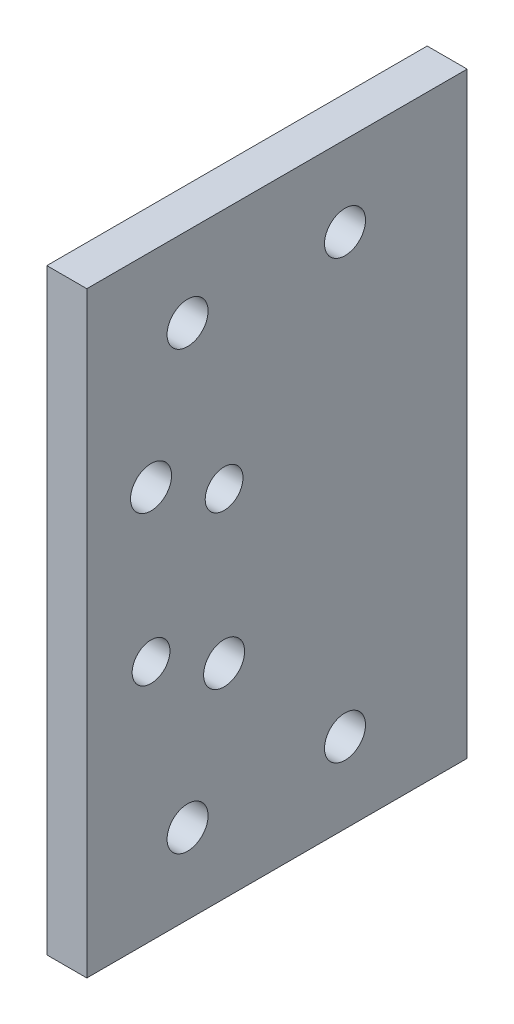
ISO-10303-21;
HEADER;
FILE_DESCRIPTION(('STEP AP214'),'2;1');
FILE_NAME('part.step','',(''),(''),'','','');
FILE_SCHEMA(('AUTOMOTIVE_DESIGN { 1 0 10303 214 1 1 1 1 }'));
ENDSEC;
DATA;
#1=APPLICATION_CONTEXT('core data for automotive mechanical design processes');
#2=APPLICATION_PROTOCOL_DEFINITION('international standard','automotive_design',2000,#1);
#3=PRODUCT_CONTEXT('',#1,'mechanical');
#4=PRODUCT('Part','Part','',(#3));
#5=PRODUCT_RELATED_PRODUCT_CATEGORY('part','',(#4));
#6=PRODUCT_DEFINITION_FORMATION('','',#4);
#7=PRODUCT_DEFINITION_CONTEXT('part definition',#1,'design');
#8=PRODUCT_DEFINITION('design','',#6,#7);
#9=PRODUCT_DEFINITION_SHAPE('','',#8);
#10=(LENGTH_UNIT() NAMED_UNIT(*) SI_UNIT(.MILLI.,.METRE.));
#11=(NAMED_UNIT(*) PLANE_ANGLE_UNIT() SI_UNIT($,.RADIAN.));
#12=(NAMED_UNIT(*) SI_UNIT($,.STERADIAN.) SOLID_ANGLE_UNIT());
#13=UNCERTAINTY_MEASURE_WITH_UNIT(LENGTH_MEASURE(1.E-05),#10,'distance_accuracy_value','');
#14=(GEOMETRIC_REPRESENTATION_CONTEXT(3) GLOBAL_UNCERTAINTY_ASSIGNED_CONTEXT((#13)) GLOBAL_UNIT_ASSIGNED_CONTEXT((#10,
#11,#12)) REPRESENTATION_CONTEXT('',''));
#15=CARTESIAN_POINT('',(0.,0.,0.));
#16=DIRECTION('',(0.,0.,1.));
#17=DIRECTION('',(1.,0.,0.));
#18=AXIS2_PLACEMENT_3D('',#15,#16,#17);
#19=CARTESIAN_POINT('',(6.35,0.,0.));
#20=DIRECTION('',(-1.,0.,0.));
#21=DIRECTION('',(0.,0.,1.));
#22=AXIS2_PLACEMENT_3D('',#19,#20,#21);
#23=PLANE('',#22);
#24=DIRECTION('',(0.,0.,-1.));
#25=VECTOR('',#24,1.);
#26=CARTESIAN_POINT('',(6.35,-47.4,-25.));
#27=LINE('',#26,#25);
#28=CARTESIAN_POINT('',(6.35,-47.4,16.));
#29=VERTEX_POINT('',#28);
#30=CARTESIAN_POINT('',(6.35,-47.4,-44.4));
#31=VERTEX_POINT('',#30);
#32=EDGE_CURVE('E102',#29,#31,#27,.T.);
#33=ORIENTED_EDGE('',*,*,#32,.T.);
#34=DIRECTION('',(0.,-1.,0.));
#35=VECTOR('',#34,1.);
#36=CARTESIAN_POINT('',(6.35,-47.4,-44.4));
#37=LINE('',#36,#35);
#38=CARTESIAN_POINT('',(6.35,47.4,-44.4));
#39=VERTEX_POINT('',#38);
#40=EDGE_CURVE('E182',#39,#31,#37,.T.);
#41=ORIENTED_EDGE('',*,*,#40,.F.);
#42=DIRECTION('',(0.,0.,1.));
#43=VECTOR('',#42,1.);
#44=CARTESIAN_POINT('',(6.35,47.4,-69.8));
#45=LINE('',#44,#43);
#46=CARTESIAN_POINT('',(6.35,47.4,16.));
#47=VERTEX_POINT('',#46);
#48=EDGE_CURVE('E106',#39,#47,#45,.T.);
#49=ORIENTED_EDGE('',*,*,#48,.T.);
#50=DIRECTION('',(0.,-1.,0.));
#51=VECTOR('',#50,1.);
#52=CARTESIAN_POINT('',(6.35,-47.4,16.));
#53=LINE('',#52,#51);
#54=EDGE_CURVE('E70',#47,#29,#53,.T.);
#55=ORIENTED_EDGE('',*,*,#54,.T.);
#56=EDGE_LOOP('',(#33,#41,#49,#55));
#57=FACE_BOUND('',#56,.T.);
#58=CARTESIAN_POINT('',(6.35,-9.,5.8));
#59=DIRECTION('',(1.,0.,0.));
#60=DIRECTION('',(0.,0.,-1.));
#61=AXIS2_PLACEMENT_3D('',#58,#59,#60);
#62=CIRCLE('',#61,3.);
#63=CARTESIAN_POINT('',(6.35,-9.,2.8));
#64=VERTEX_POINT('',#63);
#65=EDGE_CURVE('E95',#64,#64,#62,.T.);
#66=ORIENTED_EDGE('',*,*,#65,.F.);
#67=EDGE_LOOP('',(#66));
#68=FACE_BOUND('',#67,.T.);
#69=CARTESIAN_POINT('',(6.35,-15.,-5.8));
#70=DIRECTION('',(1.,0.,0.));
#71=DIRECTION('',(0.,0.,-1.));
#72=AXIS2_PLACEMENT_3D('',#69,#70,#71);
#73=CIRCLE('',#72,3.25755);
#74=CARTESIAN_POINT('',(6.35,-15.,-9.05755));
#75=VERTEX_POINT('',#74);
#76=EDGE_CURVE('E119',#75,#75,#73,.T.);
#77=ORIENTED_EDGE('',*,*,#76,.F.);
#78=EDGE_LOOP('',(#77));
#79=FACE_BOUND('',#78,.T.);
#80=CARTESIAN_POINT('',(6.35,9.,-5.8));
#81=DIRECTION('',(1.,0.,0.));
#82=DIRECTION('',(0.,0.,1.));
#83=AXIS2_PLACEMENT_3D('',#80,#81,#82);
#84=CIRCLE('',#83,3.);
#85=CARTESIAN_POINT('',(6.35,9.,-2.8));
#86=VERTEX_POINT('',#85);
#87=EDGE_CURVE('E127',#86,#86,#84,.T.);
#88=ORIENTED_EDGE('',*,*,#87,.F.);
#89=EDGE_LOOP('',(#88));
#90=FACE_BOUND('',#89,.T.);
#91=CARTESIAN_POINT('',(6.35,15.,5.8));
#92=DIRECTION('',(1.,0.,0.));
#93=DIRECTION('',(0.,0.,1.));
#94=AXIS2_PLACEMENT_3D('',#91,#92,#93);
#95=CIRCLE('',#94,3.25755);
#96=CARTESIAN_POINT('',(6.35,15.,9.05755));
#97=VERTEX_POINT('',#96);
#98=EDGE_CURVE('E135',#97,#97,#95,.T.);
#99=ORIENTED_EDGE('',*,*,#98,.F.);
#100=EDGE_LOOP('',(#99));
#101=FACE_BOUND('',#100,.T.);
#102=CARTESIAN_POINT('',(6.35,-34.7,-25.));
#103=DIRECTION('',(1.,0.,0.));
#104=DIRECTION('',(0.,0.,-1.));
#105=AXIS2_PLACEMENT_3D('',#102,#103,#104);
#106=CIRCLE('',#105,3.25755);
#107=CARTESIAN_POINT('',(6.35,-34.7,-28.25755));
#108=VERTEX_POINT('',#107);
#109=EDGE_CURVE('E143',#108,#108,#106,.T.);
#110=ORIENTED_EDGE('',*,*,#109,.F.);
#111=EDGE_LOOP('',(#110));
#112=FACE_BOUND('',#111,.T.);
#113=CARTESIAN_POINT('',(6.35,-34.7,0.));
#114=DIRECTION('',(1.,0.,0.));
#115=DIRECTION('',(0.,0.,-1.));
#116=AXIS2_PLACEMENT_3D('',#113,#114,#115);
#117=CIRCLE('',#116,3.25755);
#118=CARTESIAN_POINT('',(6.35,-34.7,-3.25755000000002));
#119=VERTEX_POINT('',#118);
#120=EDGE_CURVE('E151',#119,#119,#117,.T.);
#121=ORIENTED_EDGE('',*,*,#120,.F.);
#122=EDGE_LOOP('',(#121));
#123=FACE_BOUND('',#122,.T.);
#124=CARTESIAN_POINT('',(6.35,34.7,0.));
#125=DIRECTION('',(1.,0.,0.));
#126=DIRECTION('',(0.,0.,-1.));
#127=AXIS2_PLACEMENT_3D('',#124,#125,#126);
#128=CIRCLE('',#127,3.25755);
#129=CARTESIAN_POINT('',(6.35,34.7,-3.25755000000002));
#130=VERTEX_POINT('',#129);
#131=EDGE_CURVE('E159',#130,#130,#128,.T.);
#132=ORIENTED_EDGE('',*,*,#131,.F.);
#133=EDGE_LOOP('',(#132));
#134=FACE_BOUND('',#133,.T.);
#135=CARTESIAN_POINT('',(6.35,34.7,-25.));
#136=DIRECTION('',(1.,0.,0.));
#137=DIRECTION('',(0.,0.,-1.));
#138=AXIS2_PLACEMENT_3D('',#135,#136,#137);
#139=CIRCLE('',#138,3.25755);
#140=CARTESIAN_POINT('',(6.35,34.7,-28.25755));
#141=VERTEX_POINT('',#140);
#142=EDGE_CURVE('E167',#141,#141,#139,.T.);
#143=ORIENTED_EDGE('',*,*,#142,.F.);
#144=EDGE_LOOP('',(#143));
#145=FACE_BOUND('',#144,.T.);
#146=ADVANCED_FACE('F45',(#57,#68,#79,#90,#101,#112,#123,#134,#145),#23,.F.);
#147=CARTESIAN_POINT('',(0.,0.,0.));
#148=DIRECTION('',(-1.,0.,0.));
#149=DIRECTION('',(0.,0.,1.));
#150=AXIS2_PLACEMENT_3D('',#147,#148,#149);
#151=PLANE('',#150);
#152=DIRECTION('',(0.,-1.,0.));
#153=VECTOR('',#152,1.);
#154=CARTESIAN_POINT('',(0.,-47.4,-44.4));
#155=LINE('',#154,#153);
#156=CARTESIAN_POINT('',(0.,47.4,-44.4));
#157=VERTEX_POINT('',#156);
#158=CARTESIAN_POINT('',(0.,-47.4,-44.4));
#159=VERTEX_POINT('',#158);
#160=EDGE_CURVE('E61',#157,#159,#155,.T.);
#161=ORIENTED_EDGE('',*,*,#160,.T.);
#162=DIRECTION('',(0.,0.,-1.));
#163=VECTOR('',#162,1.);
#164=CARTESIAN_POINT('',(0.,-47.4,-25.));
#165=LINE('',#164,#163);
#166=CARTESIAN_POINT('',(0.,-47.4,16.));
#167=VERTEX_POINT('',#166);
#168=EDGE_CURVE('E83',#167,#159,#165,.T.);
#169=ORIENTED_EDGE('',*,*,#168,.F.);
#170=DIRECTION('',(0.,-1.,0.));
#171=VECTOR('',#170,1.);
#172=CARTESIAN_POINT('',(0.,-47.4,16.));
#173=LINE('',#172,#171);
#174=CARTESIAN_POINT('',(0.,47.4,16.));
#175=VERTEX_POINT('',#174);
#176=EDGE_CURVE('E88',#175,#167,#173,.T.);
#177=ORIENTED_EDGE('',*,*,#176,.F.);
#178=DIRECTION('',(0.,0.,1.));
#179=VECTOR('',#178,1.);
#180=CARTESIAN_POINT('',(0.,47.4,-69.8));
#181=LINE('',#180,#179);
#182=EDGE_CURVE('E94',#157,#175,#181,.T.);
#183=ORIENTED_EDGE('',*,*,#182,.F.);
#184=EDGE_LOOP('',(#161,#169,#177,#183));
#185=FACE_BOUND('',#184,.T.);
#186=CARTESIAN_POINT('',(0.,34.7,0.));
#187=DIRECTION('',(1.,0.,0.));
#188=DIRECTION('',(0.,0.,-1.));
#189=AXIS2_PLACEMENT_3D('',#186,#187,#188);
#190=CIRCLE('',#189,3.25755);
#191=CARTESIAN_POINT('',(0.,34.7,-3.25755000000002));
#192=VERTEX_POINT('',#191);
#193=EDGE_CURVE('E163',#192,#192,#190,.T.);
#194=ORIENTED_EDGE('',*,*,#193,.T.);
#195=EDGE_LOOP('',(#194));
#196=FACE_BOUND('',#195,.T.);
#197=CARTESIAN_POINT('',(0.,-34.7,-25.));
#198=DIRECTION('',(1.,0.,0.));
#199=DIRECTION('',(0.,0.,-1.));
#200=AXIS2_PLACEMENT_3D('',#197,#198,#199);
#201=CIRCLE('',#200,3.25755);
#202=CARTESIAN_POINT('',(0.,-34.7,-28.25755));
#203=VERTEX_POINT('',#202);
#204=EDGE_CURVE('E147',#203,#203,#201,.T.);
#205=ORIENTED_EDGE('',*,*,#204,.T.);
#206=EDGE_LOOP('',(#205));
#207=FACE_BOUND('',#206,.T.);
#208=CARTESIAN_POINT('',(0.,9.,-5.8));
#209=DIRECTION('',(1.,0.,0.));
#210=DIRECTION('',(0.,0.,1.));
#211=AXIS2_PLACEMENT_3D('',#208,#209,#210);
#212=CIRCLE('',#211,3.);
#213=CARTESIAN_POINT('',(0.,9.,-2.8));
#214=VERTEX_POINT('',#213);
#215=EDGE_CURVE('E131',#214,#214,#212,.T.);
#216=ORIENTED_EDGE('',*,*,#215,.T.);
#217=EDGE_LOOP('',(#216));
#218=FACE_BOUND('',#217,.T.);
#219=CARTESIAN_POINT('',(0.,-9.,5.8));
#220=DIRECTION('',(1.,0.,0.));
#221=DIRECTION('',(0.,0.,-1.));
#222=AXIS2_PLACEMENT_3D('',#219,#220,#221);
#223=CIRCLE('',#222,3.);
#224=CARTESIAN_POINT('',(0.,-9.,2.8));
#225=VERTEX_POINT('',#224);
#226=EDGE_CURVE('E115',#225,#225,#223,.T.);
#227=ORIENTED_EDGE('',*,*,#226,.T.);
#228=EDGE_LOOP('',(#227));
#229=FACE_BOUND('',#228,.T.);
#230=CARTESIAN_POINT('',(0.,-15.,-5.8));
#231=DIRECTION('',(1.,0.,0.));
#232=DIRECTION('',(0.,0.,-1.));
#233=AXIS2_PLACEMENT_3D('',#230,#231,#232);
#234=CIRCLE('',#233,3.25755);
#235=CARTESIAN_POINT('',(0.,-15.,-9.05755));
#236=VERTEX_POINT('',#235);
#237=EDGE_CURVE('E123',#236,#236,#234,.T.);
#238=ORIENTED_EDGE('',*,*,#237,.T.);
#239=EDGE_LOOP('',(#238));
#240=FACE_BOUND('',#239,.T.);
#241=CARTESIAN_POINT('',(0.,15.,5.8));
#242=DIRECTION('',(1.,0.,0.));
#243=DIRECTION('',(0.,0.,1.));
#244=AXIS2_PLACEMENT_3D('',#241,#242,#243);
#245=CIRCLE('',#244,3.25755);
#246=CARTESIAN_POINT('',(0.,15.,9.05755));
#247=VERTEX_POINT('',#246);
#248=EDGE_CURVE('E139',#247,#247,#245,.T.);
#249=ORIENTED_EDGE('',*,*,#248,.T.);
#250=EDGE_LOOP('',(#249));
#251=FACE_BOUND('',#250,.T.);
#252=CARTESIAN_POINT('',(0.,-34.7,0.));
#253=DIRECTION('',(1.,0.,0.));
#254=DIRECTION('',(0.,0.,-1.));
#255=AXIS2_PLACEMENT_3D('',#252,#253,#254);
#256=CIRCLE('',#255,3.25755);
#257=CARTESIAN_POINT('',(0.,-34.7,-3.25755000000002));
#258=VERTEX_POINT('',#257);
#259=EDGE_CURVE('E155',#258,#258,#256,.T.);
#260=ORIENTED_EDGE('',*,*,#259,.T.);
#261=EDGE_LOOP('',(#260));
#262=FACE_BOUND('',#261,.T.);
#263=CARTESIAN_POINT('',(0.,34.7,-25.));
#264=DIRECTION('',(1.,0.,0.));
#265=DIRECTION('',(0.,0.,-1.));
#266=AXIS2_PLACEMENT_3D('',#263,#264,#265);
#267=CIRCLE('',#266,3.25755);
#268=CARTESIAN_POINT('',(0.,34.7,-28.25755));
#269=VERTEX_POINT('',#268);
#270=EDGE_CURVE('E171',#269,#269,#267,.T.);
#271=ORIENTED_EDGE('',*,*,#270,.T.);
#272=EDGE_LOOP('',(#271));
#273=FACE_BOUND('',#272,.T.);
#274=ADVANCED_FACE('F85',(#185,#196,#207,#218,#229,#240,#251,#262,#273),#151,.T.);
#275=CARTESIAN_POINT('',(6.35,-47.4,-25.));
#276=DIRECTION('',(0.,1.,0.));
#277=DIRECTION('',(0.,0.,1.));
#278=AXIS2_PLACEMENT_3D('',#275,#276,#277);
#279=PLANE('',#278);
#280=ORIENTED_EDGE('',*,*,#168,.T.);
#281=DIRECTION('',(1.,0.,0.));
#282=VECTOR('',#281,1.);
#283=CARTESIAN_POINT('',(-98.1437720897256,-47.4,-44.4));
#284=LINE('',#283,#282);
#285=EDGE_CURVE('E175',#159,#31,#284,.T.);
#286=ORIENTED_EDGE('',*,*,#285,.T.);
#287=ORIENTED_EDGE('',*,*,#32,.F.);
#288=DIRECTION('',(-1.,0.,0.));
#289=VECTOR('',#288,1.);
#290=CARTESIAN_POINT('',(6.35,-47.4,16.));
#291=LINE('',#290,#289);
#292=EDGE_CURVE('E54',#29,#167,#291,.T.);
#293=ORIENTED_EDGE('',*,*,#292,.T.);
#294=EDGE_LOOP('',(#280,#286,#287,#293));
#295=FACE_BOUND('',#294,.T.);
#296=ADVANCED_FACE('F47',(#295),#279,.F.);
#297=CARTESIAN_POINT('',(6.35,47.4,-69.8));
#298=DIRECTION('',(0.,-1.,0.));
#299=DIRECTION('',(0.,0.,-1.));
#300=AXIS2_PLACEMENT_3D('',#297,#298,#299);
#301=PLANE('',#300);
#302=ORIENTED_EDGE('',*,*,#48,.F.);
#303=DIRECTION('',(1.,0.,0.));
#304=VECTOR('',#303,1.);
#305=CARTESIAN_POINT('',(-98.1437720897256,47.4,-44.4));
#306=LINE('',#305,#304);
#307=EDGE_CURVE('E179',#157,#39,#306,.T.);
#308=ORIENTED_EDGE('',*,*,#307,.F.);
#309=ORIENTED_EDGE('',*,*,#182,.T.);
#310=DIRECTION('',(-1.,0.,0.));
#311=VECTOR('',#310,1.);
#312=CARTESIAN_POINT('',(6.35,47.4,16.));
#313=LINE('',#312,#311);
#314=EDGE_CURVE('E11',#47,#175,#313,.T.);
#315=ORIENTED_EDGE('',*,*,#314,.F.);
#316=EDGE_LOOP('',(#302,#308,#309,#315));
#317=FACE_BOUND('',#316,.T.);
#318=ADVANCED_FACE('F225',(#317),#301,.F.);
#319=CARTESIAN_POINT('',(6.35,-47.4,16.));
#320=DIRECTION('',(0.,0.,-1.));
#321=DIRECTION('',(-1.,0.,0.));
#322=AXIS2_PLACEMENT_3D('',#319,#320,#321);
#323=PLANE('',#322);
#324=ORIENTED_EDGE('',*,*,#176,.T.);
#325=ORIENTED_EDGE('',*,*,#292,.F.);
#326=ORIENTED_EDGE('',*,*,#54,.F.);
#327=ORIENTED_EDGE('',*,*,#314,.T.);
#328=EDGE_LOOP('',(#324,#325,#326,#327));
#329=FACE_BOUND('',#328,.T.);
#330=ADVANCED_FACE('F98',(#329),#323,.F.);
#331=CARTESIAN_POINT('',(6.35,-9.,5.8));
#332=DIRECTION('',(-1.,0.,0.));
#333=DIRECTION('',(0.,0.,1.));
#334=AXIS2_PLACEMENT_3D('',#331,#332,#333);
#335=CYLINDRICAL_SURFACE('',#334,3.);
#336=ORIENTED_EDGE('',*,*,#65,.T.);
#337=EDGE_LOOP('',(#336));
#338=FACE_BOUND('',#337,.T.);
#339=ORIENTED_EDGE('',*,*,#226,.F.);
#340=EDGE_LOOP('',(#339));
#341=FACE_BOUND('',#340,.T.);
#342=ADVANCED_FACE('F229',(#338,#341),#335,.F.);
#343=CARTESIAN_POINT('',(6.35,-15.,-5.8));
#344=DIRECTION('',(-1.,0.,0.));
#345=DIRECTION('',(0.,0.,1.));
#346=AXIS2_PLACEMENT_3D('',#343,#344,#345);
#347=CYLINDRICAL_SURFACE('',#346,3.25755);
#348=ORIENTED_EDGE('',*,*,#76,.T.);
#349=EDGE_LOOP('',(#348));
#350=FACE_BOUND('',#349,.T.);
#351=ORIENTED_EDGE('',*,*,#237,.F.);
#352=EDGE_LOOP('',(#351));
#353=FACE_BOUND('',#352,.T.);
#354=ADVANCED_FACE('F301',(#350,#353),#347,.F.);
#355=CARTESIAN_POINT('',(6.35,9.,-5.8));
#356=DIRECTION('',(-1.,0.,0.));
#357=DIRECTION('',(0.,0.,1.));
#358=AXIS2_PLACEMENT_3D('',#355,#356,#357);
#359=CYLINDRICAL_SURFACE('',#358,3.);
#360=ORIENTED_EDGE('',*,*,#87,.T.);
#361=EDGE_LOOP('',(#360));
#362=FACE_BOUND('',#361,.T.);
#363=ORIENTED_EDGE('',*,*,#215,.F.);
#364=EDGE_LOOP('',(#363));
#365=FACE_BOUND('',#364,.T.);
#366=ADVANCED_FACE('F291',(#362,#365),#359,.F.);
#367=CARTESIAN_POINT('',(6.35,15.,5.8));
#368=DIRECTION('',(-1.,0.,0.));
#369=DIRECTION('',(0.,0.,1.));
#370=AXIS2_PLACEMENT_3D('',#367,#368,#369);
#371=CYLINDRICAL_SURFACE('',#370,3.25755);
#372=ORIENTED_EDGE('',*,*,#98,.T.);
#373=EDGE_LOOP('',(#372));
#374=FACE_BOUND('',#373,.T.);
#375=ORIENTED_EDGE('',*,*,#248,.F.);
#376=EDGE_LOOP('',(#375));
#377=FACE_BOUND('',#376,.T.);
#378=ADVANCED_FACE('F281',(#374,#377),#371,.F.);
#379=CARTESIAN_POINT('',(6.35,-34.7,-25.));
#380=DIRECTION('',(-1.,0.,0.));
#381=DIRECTION('',(0.,0.,1.));
#382=AXIS2_PLACEMENT_3D('',#379,#380,#381);
#383=CYLINDRICAL_SURFACE('',#382,3.25755);
#384=ORIENTED_EDGE('',*,*,#109,.T.);
#385=EDGE_LOOP('',(#384));
#386=FACE_BOUND('',#385,.T.);
#387=ORIENTED_EDGE('',*,*,#204,.F.);
#388=EDGE_LOOP('',(#387));
#389=FACE_BOUND('',#388,.T.);
#390=ADVANCED_FACE('F271',(#386,#389),#383,.F.);
#391=CARTESIAN_POINT('',(6.35,-34.7,0.));
#392=DIRECTION('',(-1.,0.,0.));
#393=DIRECTION('',(0.,0.,1.));
#394=AXIS2_PLACEMENT_3D('',#391,#392,#393);
#395=CYLINDRICAL_SURFACE('',#394,3.25755);
#396=ORIENTED_EDGE('',*,*,#120,.T.);
#397=EDGE_LOOP('',(#396));
#398=FACE_BOUND('',#397,.T.);
#399=ORIENTED_EDGE('',*,*,#259,.F.);
#400=EDGE_LOOP('',(#399));
#401=FACE_BOUND('',#400,.T.);
#402=ADVANCED_FACE('F261',(#398,#401),#395,.F.);
#403=CARTESIAN_POINT('',(6.35,34.7,0.));
#404=DIRECTION('',(-1.,0.,0.));
#405=DIRECTION('',(0.,0.,1.));
#406=AXIS2_PLACEMENT_3D('',#403,#404,#405);
#407=CYLINDRICAL_SURFACE('',#406,3.25755);
#408=ORIENTED_EDGE('',*,*,#131,.T.);
#409=EDGE_LOOP('',(#408));
#410=FACE_BOUND('',#409,.T.);
#411=ORIENTED_EDGE('',*,*,#193,.F.);
#412=EDGE_LOOP('',(#411));
#413=FACE_BOUND('',#412,.T.);
#414=ADVANCED_FACE('F216',(#410,#413),#407,.F.);
#415=CARTESIAN_POINT('',(6.35,34.7,-25.));
#416=DIRECTION('',(-1.,0.,0.));
#417=DIRECTION('',(0.,0.,1.));
#418=AXIS2_PLACEMENT_3D('',#415,#416,#417);
#419=CYLINDRICAL_SURFACE('',#418,3.25755);
#420=ORIENTED_EDGE('',*,*,#142,.T.);
#421=EDGE_LOOP('',(#420));
#422=FACE_BOUND('',#421,.T.);
#423=ORIENTED_EDGE('',*,*,#270,.F.);
#424=EDGE_LOOP('',(#423));
#425=FACE_BOUND('',#424,.T.);
#426=ADVANCED_FACE('F213',(#422,#425),#419,.F.);
#427=CARTESIAN_POINT('',(-98.1437720897256,-47.4,-44.4));
#428=DIRECTION('',(0.,0.,1.));
#429=DIRECTION('',(1.,0.,0.));
#430=AXIS2_PLACEMENT_3D('',#427,#428,#429);
#431=PLANE('',#430);
#432=ORIENTED_EDGE('',*,*,#307,.T.);
#433=ORIENTED_EDGE('',*,*,#40,.T.);
#434=ORIENTED_EDGE('',*,*,#285,.F.);
#435=ORIENTED_EDGE('',*,*,#160,.F.);
#436=EDGE_LOOP('',(#432,#433,#434,#435));
#437=FACE_BOUND('',#436,.T.);
#438=ADVANCED_FACE('F190',(#437),#431,.F.);
#439=CLOSED_SHELL('',(#146,#274,#296,#318,#330,#342,#354,#366,#378,#390,#402,#414,#426,#438));
#440=MANIFOLD_SOLID_BREP('B2',#439);
#441=ADVANCED_BREP_SHAPE_REPRESENTATION('',(#18,#440),#14);
#442=SHAPE_DEFINITION_REPRESENTATION(#9,#441);
ENDSEC;
END-ISO-10303-21;
